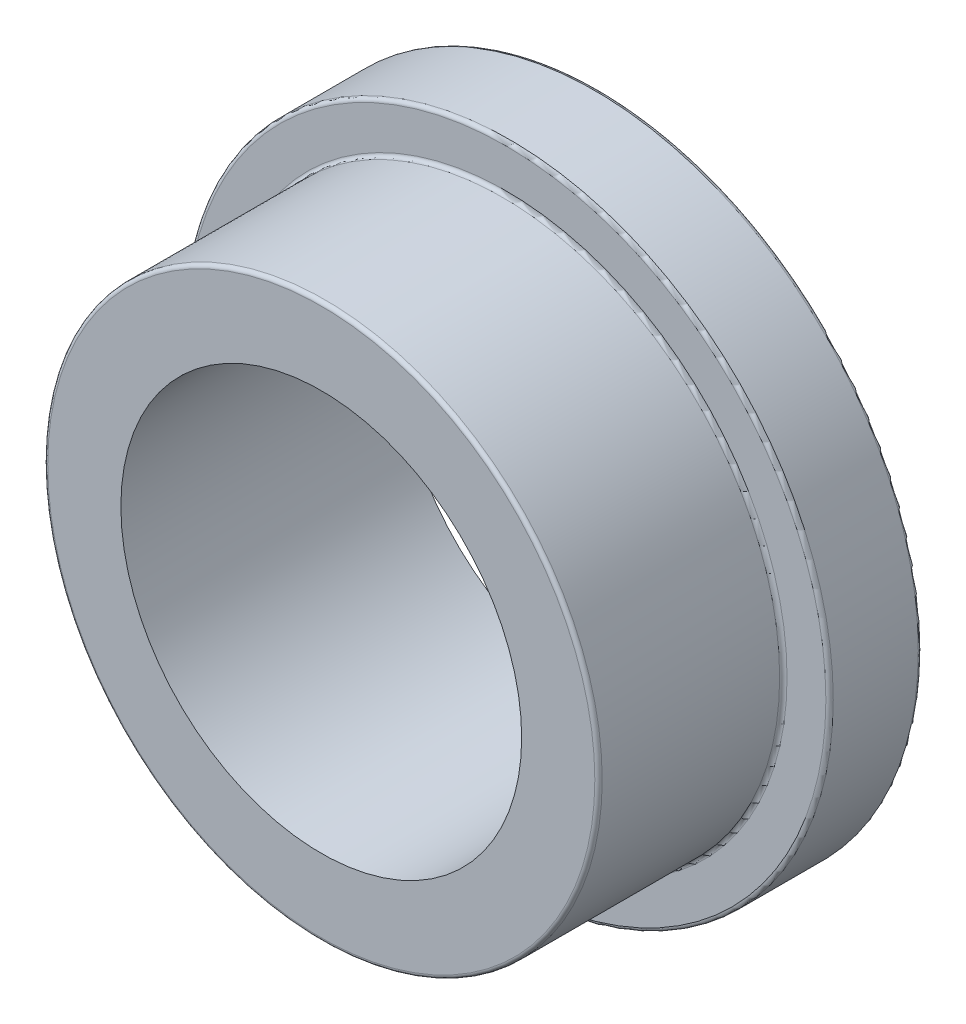
ISO-10303-21;
HEADER;
FILE_DESCRIPTION(('STEP AP214'),'2;1');
FILE_NAME('part.step','',(''),(''),'','','');
FILE_SCHEMA(('AUTOMOTIVE_DESIGN { 1 0 10303 214 1 1 1 1 }'));
ENDSEC;
DATA;
#1=APPLICATION_CONTEXT('core data for automotive mechanical design processes');
#2=APPLICATION_PROTOCOL_DEFINITION('international standard','automotive_design',2000,#1);
#3=PRODUCT_CONTEXT('',#1,'mechanical');
#4=PRODUCT('Part','Part','',(#3));
#5=PRODUCT_RELATED_PRODUCT_CATEGORY('part','',(#4));
#6=PRODUCT_DEFINITION_FORMATION('','',#4);
#7=PRODUCT_DEFINITION_CONTEXT('part definition',#1,'design');
#8=PRODUCT_DEFINITION('design','',#6,#7);
#9=PRODUCT_DEFINITION_SHAPE('','',#8);
#10=(LENGTH_UNIT() NAMED_UNIT(*) SI_UNIT(.MILLI.,.METRE.));
#11=(NAMED_UNIT(*) PLANE_ANGLE_UNIT() SI_UNIT($,.RADIAN.));
#12=(NAMED_UNIT(*) SI_UNIT($,.STERADIAN.) SOLID_ANGLE_UNIT());
#13=UNCERTAINTY_MEASURE_WITH_UNIT(LENGTH_MEASURE(1.E-05),#10,'distance_accuracy_value','');
#14=(GEOMETRIC_REPRESENTATION_CONTEXT(3) GLOBAL_UNCERTAINTY_ASSIGNED_CONTEXT((#13)) GLOBAL_UNIT_ASSIGNED_CONTEXT((#10,
#11,#12)) REPRESENTATION_CONTEXT('',''));
#15=CARTESIAN_POINT('',(0.,0.,0.));
#16=DIRECTION('',(0.,0.,1.));
#17=DIRECTION('',(1.,0.,0.));
#18=AXIS2_PLACEMENT_3D('',#15,#16,#17);
#19=CARTESIAN_POINT('',(0.,0.,-3.175));
#20=DIRECTION('',(0.,0.,1.));
#21=DIRECTION('',(1.,0.,0.));
#22=AXIS2_PLACEMENT_3D('',#19,#20,#21);
#23=CYLINDRICAL_SURFACE('',#22,6.885);
#24=CARTESIAN_POINT('',(0.,0.,6.35));
#25=DIRECTION('',(0.,0.,1.));
#26=DIRECTION('',(1.,0.,0.));
#27=AXIS2_PLACEMENT_3D('',#24,#25,#26);
#28=CIRCLE('',#27,6.885);
#29=CARTESIAN_POINT('',(6.885,0.,6.35));
#30=VERTEX_POINT('',#29);
#31=EDGE_CURVE('E68',#30,#30,#28,.T.);
#32=ORIENTED_EDGE('',*,*,#31,.T.);
#33=EDGE_LOOP('',(#32));
#34=FACE_BOUND('',#33,.T.);
#35=CARTESIAN_POINT('',(0.,0.,-3.175));
#36=DIRECTION('',(0.,0.,1.));
#37=DIRECTION('',(1.,0.,0.));
#38=AXIS2_PLACEMENT_3D('',#35,#36,#37);
#39=CIRCLE('',#38,6.885);
#40=CARTESIAN_POINT('',(6.885,0.,-3.175));
#41=VERTEX_POINT('',#40);
#42=EDGE_CURVE('E75',#41,#41,#39,.T.);
#43=ORIENTED_EDGE('',*,*,#42,.F.);
#44=EDGE_LOOP('',(#43));
#45=FACE_BOUND('',#44,.T.);
#46=ADVANCED_FACE('F40',(#34,#45),#23,.F.);
#47=CARTESIAN_POINT('',(6.885,0.,6.35));
#48=DIRECTION('',(0.,0.,1.));
#49=DIRECTION('',(1.,0.,0.));
#50=AXIS2_PLACEMENT_3D('',#47,#48,#49);
#51=PLANE('',#50);
#52=CARTESIAN_POINT('',(0.,0.,6.35));
#53=DIRECTION('',(0.,0.,1.));
#54=DIRECTION('',(1.,0.,0.));
#55=AXIS2_PLACEMENT_3D('',#52,#53,#54);
#56=CIRCLE('',#55,9.398);
#57=CARTESIAN_POINT('',(9.398,0.,6.35));
#58=VERTEX_POINT('',#57);
#59=EDGE_CURVE('E55',#58,#58,#56,.T.);
#60=ORIENTED_EDGE('',*,*,#59,.T.);
#61=EDGE_LOOP('',(#60));
#62=FACE_BOUND('',#61,.T.);
#63=ORIENTED_EDGE('',*,*,#31,.F.);
#64=EDGE_LOOP('',(#63));
#65=FACE_BOUND('',#64,.T.);
#66=ADVANCED_FACE('F78',(#62,#65),#51,.T.);
#67=CARTESIAN_POINT('',(0.,0.,-3.175));
#68=DIRECTION('',(0.,0.,1.));
#69=DIRECTION('',(1.,0.,0.));
#70=AXIS2_PLACEMENT_3D('',#67,#68,#69);
#71=CYLINDRICAL_SURFACE('',#70,9.525);
#72=CARTESIAN_POINT('',(0.,0.,0.127));
#73=DIRECTION('',(0.,0.,1.));
#74=DIRECTION('',(1.,0.,0.));
#75=AXIS2_PLACEMENT_3D('',#72,#73,#74);
#76=CIRCLE('',#75,9.525);
#77=CARTESIAN_POINT('',(9.525,0.,0.127));
#78=VERTEX_POINT('',#77);
#79=EDGE_CURVE('E64',#78,#78,#76,.T.);
#80=ORIENTED_EDGE('',*,*,#79,.T.);
#81=EDGE_LOOP('',(#80));
#82=FACE_BOUND('',#81,.T.);
#83=CARTESIAN_POINT('',(0.,0.,6.223));
#84=DIRECTION('',(0.,0.,1.));
#85=DIRECTION('',(1.,0.,0.));
#86=AXIS2_PLACEMENT_3D('',#83,#84,#85);
#87=CIRCLE('',#86,9.525);
#88=CARTESIAN_POINT('',(9.525,0.,6.223));
#89=VERTEX_POINT('',#88);
#90=EDGE_CURVE('E66',#89,#89,#87,.F.);
#91=ORIENTED_EDGE('',*,*,#90,.T.);
#92=EDGE_LOOP('',(#91));
#93=FACE_BOUND('',#92,.T.);
#94=ADVANCED_FACE('F84',(#82,#93),#71,.T.);
#95=CARTESIAN_POINT('',(9.525,0.,0.));
#96=DIRECTION('',(0.,0.,1.));
#97=DIRECTION('',(1.,0.,0.));
#98=AXIS2_PLACEMENT_3D('',#95,#96,#97);
#99=PLANE('',#98);
#100=CARTESIAN_POINT('',(0.,0.,0.));
#101=DIRECTION('',(0.,0.,1.));
#102=DIRECTION('',(1.,0.,0.));
#103=AXIS2_PLACEMENT_3D('',#100,#101,#102);
#104=CIRCLE('',#103,9.652);
#105=CARTESIAN_POINT('',(9.652,0.,0.));
#106=VERTEX_POINT('',#105);
#107=EDGE_CURVE('E60',#106,#106,#104,.F.);
#108=ORIENTED_EDGE('',*,*,#107,.T.);
#109=EDGE_LOOP('',(#108));
#110=FACE_BOUND('',#109,.T.);
#111=CARTESIAN_POINT('',(0.,0.,0.));
#112=DIRECTION('',(0.,0.,1.));
#113=DIRECTION('',(1.,0.,0.));
#114=AXIS2_PLACEMENT_3D('',#111,#112,#113);
#115=CIRCLE('',#114,10.9855);
#116=CARTESIAN_POINT('',(10.9855,0.,0.));
#117=VERTEX_POINT('',#116);
#118=EDGE_CURVE('E58',#117,#117,#115,.T.);
#119=ORIENTED_EDGE('',*,*,#118,.T.);
#120=EDGE_LOOP('',(#119));
#121=FACE_BOUND('',#120,.T.);
#122=ADVANCED_FACE('F110',(#110,#121),#99,.T.);
#123=CARTESIAN_POINT('',(0.,0.,-3.175));
#124=DIRECTION('',(0.,0.,1.));
#125=DIRECTION('',(1.,0.,0.));
#126=AXIS2_PLACEMENT_3D('',#123,#124,#125);
#127=CYLINDRICAL_SURFACE('',#126,11.1125);
#128=CARTESIAN_POINT('',(0.,0.,-0.127));
#129=DIRECTION('',(0.,0.,1.));
#130=DIRECTION('',(1.,0.,0.));
#131=AXIS2_PLACEMENT_3D('',#128,#129,#130);
#132=CIRCLE('',#131,11.1125);
#133=CARTESIAN_POINT('',(11.1125,0.,-0.127));
#134=VERTEX_POINT('',#133);
#135=EDGE_CURVE('E42',#134,#134,#132,.F.);
#136=ORIENTED_EDGE('',*,*,#135,.T.);
#137=EDGE_LOOP('',(#136));
#138=FACE_BOUND('',#137,.T.);
#139=CARTESIAN_POINT('',(0.,0.,-3.048));
#140=DIRECTION('',(0.,0.,-1.));
#141=DIRECTION('',(-1.,0.,0.));
#142=AXIS2_PLACEMENT_3D('',#139,#140,#141);
#143=CIRCLE('',#142,11.1125);
#144=CARTESIAN_POINT('',(-11.1125,0.,-3.048));
#145=VERTEX_POINT('',#144);
#146=EDGE_CURVE('E48',#145,#145,#143,.F.);
#147=ORIENTED_EDGE('',*,*,#146,.T.);
#148=EDGE_LOOP('',(#147));
#149=FACE_BOUND('',#148,.T.);
#150=ADVANCED_FACE('F108',(#138,#149),#127,.T.);
#151=CARTESIAN_POINT('',(11.1125,0.,-3.175));
#152=DIRECTION('',(0.,0.,-1.));
#153=DIRECTION('',(-1.,0.,0.));
#154=AXIS2_PLACEMENT_3D('',#151,#152,#153);
#155=PLANE('',#154);
#156=CARTESIAN_POINT('',(0.,0.,-3.175));
#157=DIRECTION('',(0.,0.,-1.));
#158=DIRECTION('',(-1.,0.,0.));
#159=AXIS2_PLACEMENT_3D('',#156,#157,#158);
#160=CIRCLE('',#159,10.9855);
#161=CARTESIAN_POINT('',(-10.9855,0.,-3.175));
#162=VERTEX_POINT('',#161);
#163=EDGE_CURVE('E10',#162,#162,#160,.T.);
#164=ORIENTED_EDGE('',*,*,#163,.T.);
#165=EDGE_LOOP('',(#164));
#166=FACE_BOUND('',#165,.T.);
#167=ORIENTED_EDGE('',*,*,#42,.T.);
#168=EDGE_LOOP('',(#167));
#169=FACE_BOUND('',#168,.T.);
#170=ADVANCED_FACE('F76',(#166,#169),#155,.T.);
#171=CARTESIAN_POINT('',(0.,0.,0.127));
#172=DIRECTION('',(0.,0.,1.));
#173=DIRECTION('',(1.,0.,0.));
#174=AXIS2_PLACEMENT_3D('',#171,#172,#173);
#175=TOROIDAL_SURFACE('',#174,9.652,0.127);
#176=ORIENTED_EDGE('',*,*,#107,.F.);
#177=EDGE_LOOP('',(#176));
#178=FACE_BOUND('',#177,.T.);
#179=ORIENTED_EDGE('',*,*,#79,.F.);
#180=EDGE_LOOP('',(#179));
#181=FACE_BOUND('',#180,.T.);
#182=ADVANCED_FACE('F89',(#178,#181),#175,.F.);
#183=CARTESIAN_POINT('',(0.,0.,6.223));
#184=DIRECTION('',(0.,0.,1.));
#185=DIRECTION('',(1.,0.,0.));
#186=AXIS2_PLACEMENT_3D('',#183,#184,#185);
#187=TOROIDAL_SURFACE('',#186,9.398,0.127);
#188=ORIENTED_EDGE('',*,*,#90,.F.);
#189=EDGE_LOOP('',(#188));
#190=FACE_BOUND('',#189,.T.);
#191=ORIENTED_EDGE('',*,*,#59,.F.);
#192=EDGE_LOOP('',(#191));
#193=FACE_BOUND('',#192,.T.);
#194=ADVANCED_FACE('F91',(#190,#193),#187,.T.);
#195=CARTESIAN_POINT('',(0.,0.,-0.127));
#196=DIRECTION('',(0.,0.,1.));
#197=DIRECTION('',(1.,0.,0.));
#198=AXIS2_PLACEMENT_3D('',#195,#196,#197);
#199=TOROIDAL_SURFACE('',#198,10.9855,0.127);
#200=ORIENTED_EDGE('',*,*,#135,.F.);
#201=EDGE_LOOP('',(#200));
#202=FACE_BOUND('',#201,.T.);
#203=ORIENTED_EDGE('',*,*,#118,.F.);
#204=EDGE_LOOP('',(#203));
#205=FACE_BOUND('',#204,.T.);
#206=ADVANCED_FACE('F96',(#202,#205),#199,.T.);
#207=CARTESIAN_POINT('',(0.,0.,-3.048));
#208=DIRECTION('',(0.,0.,-1.));
#209=DIRECTION('',(-1.,0.,0.));
#210=AXIS2_PLACEMENT_3D('',#207,#208,#209);
#211=TOROIDAL_SURFACE('',#210,10.9855,0.127);
#212=ORIENTED_EDGE('',*,*,#163,.F.);
#213=EDGE_LOOP('',(#212));
#214=FACE_BOUND('',#213,.T.);
#215=ORIENTED_EDGE('',*,*,#146,.F.);
#216=EDGE_LOOP('',(#215));
#217=FACE_BOUND('',#216,.T.);
#218=ADVANCED_FACE('F39',(#214,#217),#211,.T.);
#219=CLOSED_SHELL('',(#46,#66,#94,#122,#150,#170,#182,#194,#206,#218));
#220=MANIFOLD_SOLID_BREP('B2',#219);
#221=ADVANCED_BREP_SHAPE_REPRESENTATION('',(#18,#220),#14);
#222=SHAPE_DEFINITION_REPRESENTATION(#9,#221);
ENDSEC;
END-ISO-10303-21;
